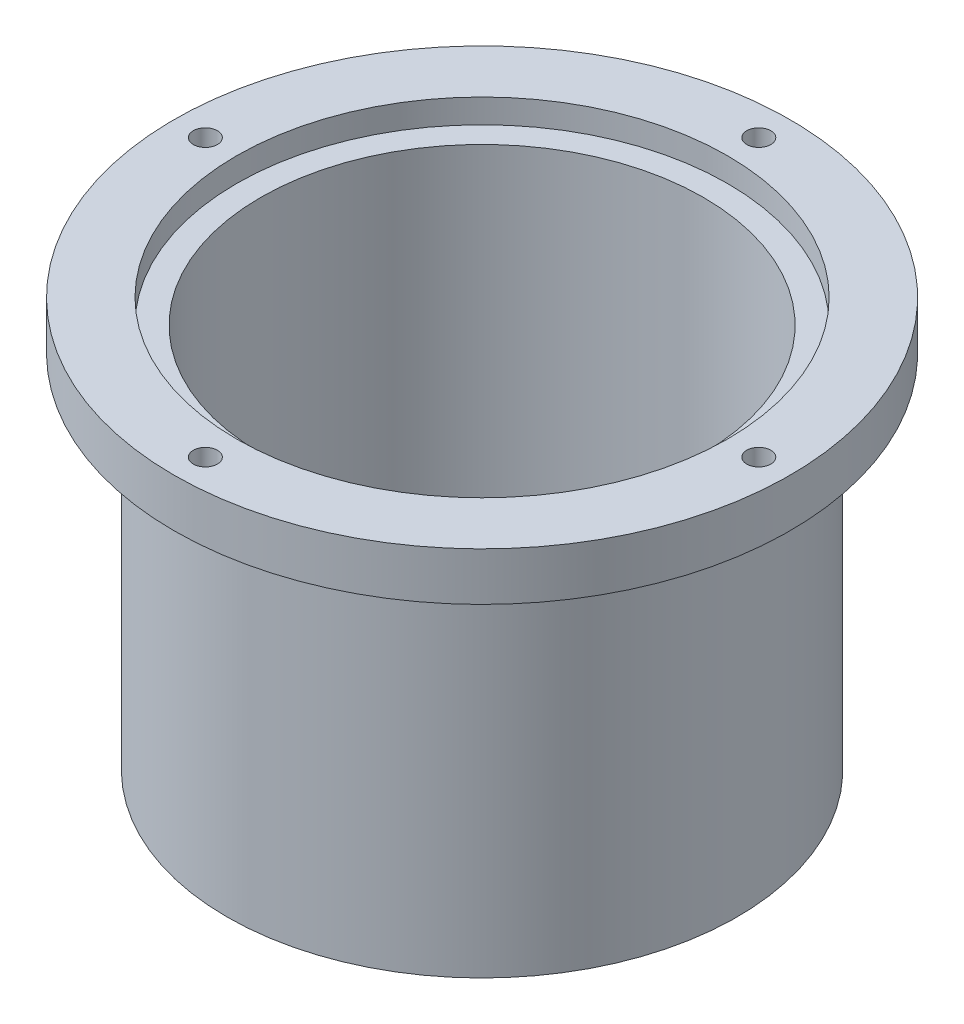
ISO-10303-21;
HEADER;
FILE_DESCRIPTION(('STEP AP214'),'2;1');
FILE_NAME('part.step','',(''),(''),'','','');
FILE_SCHEMA(('AUTOMOTIVE_DESIGN { 1 0 10303 214 1 1 1 1 }'));
ENDSEC;
DATA;
#1=APPLICATION_CONTEXT('core data for automotive mechanical design processes');
#2=APPLICATION_PROTOCOL_DEFINITION('international standard','automotive_design',2000,#1);
#3=PRODUCT_CONTEXT('',#1,'mechanical');
#4=PRODUCT('Part','Part','',(#3));
#5=PRODUCT_RELATED_PRODUCT_CATEGORY('part','',(#4));
#6=PRODUCT_DEFINITION_FORMATION('','',#4);
#7=PRODUCT_DEFINITION_CONTEXT('part definition',#1,'design');
#8=PRODUCT_DEFINITION('design','',#6,#7);
#9=PRODUCT_DEFINITION_SHAPE('','',#8);
#10=(LENGTH_UNIT() NAMED_UNIT(*) SI_UNIT(.MILLI.,.METRE.));
#11=(NAMED_UNIT(*) PLANE_ANGLE_UNIT() SI_UNIT($,.RADIAN.));
#12=(NAMED_UNIT(*) SI_UNIT($,.STERADIAN.) SOLID_ANGLE_UNIT());
#13=UNCERTAINTY_MEASURE_WITH_UNIT(LENGTH_MEASURE(1.E-05),#10,'distance_accuracy_value','');
#14=(GEOMETRIC_REPRESENTATION_CONTEXT(3) GLOBAL_UNCERTAINTY_ASSIGNED_CONTEXT((#13)) GLOBAL_UNIT_ASSIGNED_CONTEXT((#10,
#11,#12)) REPRESENTATION_CONTEXT('',''));
#15=CARTESIAN_POINT('',(0.,0.,0.));
#16=DIRECTION('',(0.,0.,1.));
#17=DIRECTION('',(1.,0.,0.));
#18=AXIS2_PLACEMENT_3D('',#15,#16,#17);
#19=CARTESIAN_POINT('',(0.,75.,0.));
#20=DIRECTION('',(0.,-1.,0.));
#21=DIRECTION('',(0.,0.,-1.));
#22=AXIS2_PLACEMENT_3D('',#19,#20,#21);
#23=CYLINDRICAL_SURFACE('',#22,53.);
#24=CARTESIAN_POINT('',(0.,75.,0.));
#25=DIRECTION('',(0.,1.,0.));
#26=DIRECTION('',(0.,0.,1.));
#27=AXIS2_PLACEMENT_3D('',#24,#25,#26);
#28=CIRCLE('',#27,53.);
#29=CARTESIAN_POINT('',(0.,75.,53.));
#30=VERTEX_POINT('',#29);
#31=EDGE_CURVE('E10',#30,#30,#28,.T.);
#32=ORIENTED_EDGE('',*,*,#31,.F.);
#33=EDGE_LOOP('',(#32));
#34=FACE_BOUND('',#33,.T.);
#35=CARTESIAN_POINT('',(0.,0.,0.));
#36=DIRECTION('',(0.,1.,0.));
#37=DIRECTION('',(0.,0.,1.));
#38=AXIS2_PLACEMENT_3D('',#35,#36,#37);
#39=CIRCLE('',#38,53.);
#40=CARTESIAN_POINT('',(0.,0.,53.));
#41=VERTEX_POINT('',#40);
#42=EDGE_CURVE('E41',#41,#41,#39,.T.);
#43=ORIENTED_EDGE('',*,*,#42,.T.);
#44=EDGE_LOOP('',(#43));
#45=FACE_BOUND('',#44,.T.);
#46=ADVANCED_FACE('F34',(#34,#45),#23,.T.);
#47=CARTESIAN_POINT('',(0.,0.,0.));
#48=DIRECTION('',(0.,1.,0.));
#49=DIRECTION('',(0.,0.,1.));
#50=AXIS2_PLACEMENT_3D('',#47,#48,#49);
#51=PLANE('',#50);
#52=ORIENTED_EDGE('',*,*,#42,.F.);
#53=EDGE_LOOP('',(#52));
#54=FACE_BOUND('',#53,.T.);
#55=ADVANCED_FACE('F104',(#54),#51,.F.);
#56=CARTESIAN_POINT('',(0.,85.,0.));
#57=DIRECTION('',(0.,-1.,0.));
#58=DIRECTION('',(0.,0.,-1.));
#59=AXIS2_PLACEMENT_3D('',#56,#57,#58);
#60=CYLINDRICAL_SURFACE('',#59,64.);
#61=CARTESIAN_POINT('',(0.,85.,0.));
#62=DIRECTION('',(0.,1.,0.));
#63=DIRECTION('',(0.,0.,1.));
#64=AXIS2_PLACEMENT_3D('',#61,#62,#63);
#65=CIRCLE('',#64,64.);
#66=CARTESIAN_POINT('',(0.,85.,64.));
#67=VERTEX_POINT('',#66);
#68=EDGE_CURVE('E46',#67,#67,#65,.T.);
#69=ORIENTED_EDGE('',*,*,#68,.F.);
#70=EDGE_LOOP('',(#69));
#71=FACE_BOUND('',#70,.T.);
#72=CARTESIAN_POINT('',(0.,75.,0.));
#73=DIRECTION('',(0.,1.,0.));
#74=DIRECTION('',(0.,0.,1.));
#75=AXIS2_PLACEMENT_3D('',#72,#73,#74);
#76=CIRCLE('',#75,64.);
#77=CARTESIAN_POINT('',(0.,75.,64.));
#78=VERTEX_POINT('',#77);
#79=EDGE_CURVE('E49',#78,#78,#76,.T.);
#80=ORIENTED_EDGE('',*,*,#79,.T.);
#81=EDGE_LOOP('',(#80));
#82=FACE_BOUND('',#81,.T.);
#83=ADVANCED_FACE('F86',(#71,#82),#60,.T.);
#84=CARTESIAN_POINT('',(0.,85.,0.));
#85=DIRECTION('',(0.,1.,0.));
#86=DIRECTION('',(0.,0.,1.));
#87=AXIS2_PLACEMENT_3D('',#84,#85,#86);
#88=PLANE('',#87);
#89=CARTESIAN_POINT('',(-57.5,85.,0.));
#90=DIRECTION('',(0.,1.,0.));
#91=DIRECTION('',(0.,0.,1.));
#92=AXIS2_PLACEMENT_3D('',#89,#90,#91);
#93=CIRCLE('',#92,2.5);
#94=CARTESIAN_POINT('',(-57.5,85.,2.50000000000001));
#95=VERTEX_POINT('',#94);
#96=EDGE_CURVE('E56',#95,#95,#93,.T.);
#97=ORIENTED_EDGE('',*,*,#96,.F.);
#98=EDGE_LOOP('',(#97));
#99=FACE_BOUND('',#98,.T.);
#100=CARTESIAN_POINT('',(1.93718457888383E-13,85.,-57.5));
#101=DIRECTION('',(0.,1.,0.));
#102=DIRECTION('',(0.,0.,1.));
#103=AXIS2_PLACEMENT_3D('',#100,#101,#102);
#104=CIRCLE('',#103,2.5);
#105=CARTESIAN_POINT('',(1.93718457888383E-13,85.,-55.));
#106=VERTEX_POINT('',#105);
#107=EDGE_CURVE('E214',#106,#106,#104,.T.);
#108=ORIENTED_EDGE('',*,*,#107,.F.);
#109=EDGE_LOOP('',(#108));
#110=FACE_BOUND('',#109,.T.);
#111=CARTESIAN_POINT('',(57.5,85.,3.94478634871863E-13));
#112=DIRECTION('',(0.,1.,0.));
#113=DIRECTION('',(0.,0.,1.));
#114=AXIS2_PLACEMENT_3D('',#111,#112,#113);
#115=CIRCLE('',#114,2.5);
#116=CARTESIAN_POINT('',(57.5,85.,2.5000000000004));
#117=VERTEX_POINT('',#116);
#118=EDGE_CURVE('E217',#117,#117,#115,.T.);
#119=ORIENTED_EDGE('',*,*,#118,.F.);
#120=EDGE_LOOP('',(#119));
#121=FACE_BOUND('',#120,.T.);
#122=CARTESIAN_POINT('',(-5.95238811855343E-13,85.,57.5));
#123=DIRECTION('',(0.,1.,0.));
#124=DIRECTION('',(0.,0.,1.));
#125=AXIS2_PLACEMENT_3D('',#122,#123,#124);
#126=CIRCLE('',#125,2.5);
#127=CARTESIAN_POINT('',(-5.95238811855343E-13,85.,60.));
#128=VERTEX_POINT('',#127);
#129=EDGE_CURVE('E221',#128,#128,#126,.T.);
#130=ORIENTED_EDGE('',*,*,#129,.F.);
#131=EDGE_LOOP('',(#130));
#132=FACE_BOUND('',#131,.T.);
#133=CARTESIAN_POINT('',(0.,85.,0.));
#134=DIRECTION('',(0.,1.,0.));
#135=DIRECTION('',(0.,0.,1.));
#136=AXIS2_PLACEMENT_3D('',#133,#134,#135);
#137=CIRCLE('',#136,51.);
#138=CARTESIAN_POINT('',(0.,85.,51.));
#139=VERTEX_POINT('',#138);
#140=EDGE_CURVE('E72',#139,#139,#137,.T.);
#141=ORIENTED_EDGE('',*,*,#140,.F.);
#142=EDGE_LOOP('',(#141));
#143=FACE_BOUND('',#142,.T.);
#144=ORIENTED_EDGE('',*,*,#68,.T.);
#145=EDGE_LOOP('',(#144));
#146=FACE_BOUND('',#145,.T.);
#147=ADVANCED_FACE('F91',(#99,#110,#121,#132,#143,#146),#88,.T.);
#148=CARTESIAN_POINT('',(0.,75.,0.));
#149=DIRECTION('',(0.,1.,0.));
#150=DIRECTION('',(0.,0.,1.));
#151=AXIS2_PLACEMENT_3D('',#148,#149,#150);
#152=PLANE('',#151);
#153=CARTESIAN_POINT('',(-57.5,75.,0.));
#154=DIRECTION('',(0.,1.,0.));
#155=DIRECTION('',(0.,0.,1.));
#156=AXIS2_PLACEMENT_3D('',#153,#154,#155);
#157=CIRCLE('',#156,2.5);
#158=CARTESIAN_POINT('',(-57.5,75.,2.50000000000001));
#159=VERTEX_POINT('',#158);
#160=EDGE_CURVE('E37',#159,#159,#157,.T.);
#161=ORIENTED_EDGE('',*,*,#160,.T.);
#162=EDGE_LOOP('',(#161));
#163=FACE_BOUND('',#162,.T.);
#164=CARTESIAN_POINT('',(1.93718457888383E-13,75.,-57.5));
#165=DIRECTION('',(0.,1.,0.));
#166=DIRECTION('',(0.,0.,1.));
#167=AXIS2_PLACEMENT_3D('',#164,#165,#166);
#168=CIRCLE('',#167,2.5);
#169=CARTESIAN_POINT('',(1.93718457888383E-13,75.,-55.));
#170=VERTEX_POINT('',#169);
#171=EDGE_CURVE('E58',#170,#170,#168,.T.);
#172=ORIENTED_EDGE('',*,*,#171,.T.);
#173=EDGE_LOOP('',(#172));
#174=FACE_BOUND('',#173,.T.);
#175=CARTESIAN_POINT('',(57.5,75.,3.94478634871863E-13));
#176=DIRECTION('',(0.,1.,0.));
#177=DIRECTION('',(0.,0.,1.));
#178=AXIS2_PLACEMENT_3D('',#175,#176,#177);
#179=CIRCLE('',#178,2.5);
#180=CARTESIAN_POINT('',(57.5,75.,2.5000000000004));
#181=VERTEX_POINT('',#180);
#182=EDGE_CURVE('E55',#181,#181,#179,.T.);
#183=ORIENTED_EDGE('',*,*,#182,.T.);
#184=EDGE_LOOP('',(#183));
#185=FACE_BOUND('',#184,.T.);
#186=CARTESIAN_POINT('',(-5.95238811855343E-13,75.,57.5));
#187=DIRECTION('',(0.,1.,0.));
#188=DIRECTION('',(0.,0.,1.));
#189=AXIS2_PLACEMENT_3D('',#186,#187,#188);
#190=CIRCLE('',#189,2.5);
#191=CARTESIAN_POINT('',(-5.95238811855343E-13,75.,60.));
#192=VERTEX_POINT('',#191);
#193=EDGE_CURVE('E52',#192,#192,#190,.T.);
#194=ORIENTED_EDGE('',*,*,#193,.T.);
#195=EDGE_LOOP('',(#194));
#196=FACE_BOUND('',#195,.T.);
#197=ORIENTED_EDGE('',*,*,#31,.T.);
#198=EDGE_LOOP('',(#197));
#199=FACE_BOUND('',#198,.T.);
#200=ORIENTED_EDGE('',*,*,#79,.F.);
#201=EDGE_LOOP('',(#200));
#202=FACE_BOUND('',#201,.T.);
#203=ADVANCED_FACE('F88',(#163,#174,#185,#196,#199,#202),#152,.F.);
#204=CARTESIAN_POINT('',(0.,80.,0.));
#205=DIRECTION('',(0.,1.,0.));
#206=DIRECTION('',(0.,0.,1.));
#207=AXIS2_PLACEMENT_3D('',#204,#205,#206);
#208=CYLINDRICAL_SURFACE('',#207,51.);
#209=CARTESIAN_POINT('',(0.,80.,0.));
#210=DIRECTION('',(0.,1.,0.));
#211=DIRECTION('',(0.,0.,1.));
#212=AXIS2_PLACEMENT_3D('',#209,#210,#211);
#213=CIRCLE('',#212,51.);
#214=CARTESIAN_POINT('',(0.,80.,51.));
#215=VERTEX_POINT('',#214);
#216=EDGE_CURVE('E76',#215,#215,#213,.T.);
#217=ORIENTED_EDGE('',*,*,#216,.F.);
#218=EDGE_LOOP('',(#217));
#219=FACE_BOUND('',#218,.T.);
#220=ORIENTED_EDGE('',*,*,#140,.T.);
#221=EDGE_LOOP('',(#220));
#222=FACE_BOUND('',#221,.T.);
#223=ADVANCED_FACE('F90',(#219,#222),#208,.F.);
#224=CARTESIAN_POINT('',(0.,80.,0.));
#225=DIRECTION('',(0.,1.,0.));
#226=DIRECTION('',(0.,0.,1.));
#227=AXIS2_PLACEMENT_3D('',#224,#225,#226);
#228=PLANE('',#227);
#229=CARTESIAN_POINT('',(0.,80.,0.));
#230=DIRECTION('',(0.,1.,0.));
#231=DIRECTION('',(0.,0.,1.));
#232=AXIS2_PLACEMENT_3D('',#229,#230,#231);
#233=CIRCLE('',#232,46.);
#234=CARTESIAN_POINT('',(0.,80.,46.));
#235=VERTEX_POINT('',#234);
#236=EDGE_CURVE('E63',#235,#235,#233,.T.);
#237=ORIENTED_EDGE('',*,*,#236,.F.);
#238=EDGE_LOOP('',(#237));
#239=FACE_BOUND('',#238,.T.);
#240=ORIENTED_EDGE('',*,*,#216,.T.);
#241=EDGE_LOOP('',(#240));
#242=FACE_BOUND('',#241,.T.);
#243=ADVANCED_FACE('F97',(#239,#242),#228,.T.);
#244=CARTESIAN_POINT('',(0.,14.,0.));
#245=DIRECTION('',(0.,1.,0.));
#246=DIRECTION('',(0.,0.,1.));
#247=AXIS2_PLACEMENT_3D('',#244,#245,#246);
#248=CYLINDRICAL_SURFACE('',#247,46.);
#249=CARTESIAN_POINT('',(0.,14.,0.));
#250=DIRECTION('',(0.,1.,0.));
#251=DIRECTION('',(0.,0.,1.));
#252=AXIS2_PLACEMENT_3D('',#249,#250,#251);
#253=CIRCLE('',#252,46.);
#254=CARTESIAN_POINT('',(0.,14.,46.));
#255=VERTEX_POINT('',#254);
#256=EDGE_CURVE('E67',#255,#255,#253,.T.);
#257=ORIENTED_EDGE('',*,*,#256,.F.);
#258=EDGE_LOOP('',(#257));
#259=FACE_BOUND('',#258,.T.);
#260=ORIENTED_EDGE('',*,*,#236,.T.);
#261=EDGE_LOOP('',(#260));
#262=FACE_BOUND('',#261,.T.);
#263=ADVANCED_FACE('F182',(#259,#262),#248,.F.);
#264=CARTESIAN_POINT('',(0.,14.,0.));
#265=DIRECTION('',(0.,1.,0.));
#266=DIRECTION('',(0.,0.,1.));
#267=AXIS2_PLACEMENT_3D('',#264,#265,#266);
#268=PLANE('',#267);
#269=ORIENTED_EDGE('',*,*,#256,.T.);
#270=EDGE_LOOP('',(#269));
#271=FACE_BOUND('',#270,.T.);
#272=ADVANCED_FACE('F129',(#271),#268,.T.);
#273=CARTESIAN_POINT('',(-5.95238811855343E-13,19.,57.5));
#274=DIRECTION('',(0.,1.,0.));
#275=DIRECTION('',(0.,0.,1.));
#276=AXIS2_PLACEMENT_3D('',#273,#274,#275);
#277=CYLINDRICAL_SURFACE('',#276,2.5);
#278=ORIENTED_EDGE('',*,*,#129,.T.);
#279=EDGE_LOOP('',(#278));
#280=FACE_BOUND('',#279,.T.);
#281=ORIENTED_EDGE('',*,*,#193,.F.);
#282=EDGE_LOOP('',(#281));
#283=FACE_BOUND('',#282,.T.);
#284=ADVANCED_FACE('F139',(#280,#283),#277,.F.);
#285=CARTESIAN_POINT('',(57.5,19.,3.94478634871863E-13));
#286=DIRECTION('',(0.,1.,0.));
#287=DIRECTION('',(0.,0.,1.));
#288=AXIS2_PLACEMENT_3D('',#285,#286,#287);
#289=CYLINDRICAL_SURFACE('',#288,2.5);
#290=ORIENTED_EDGE('',*,*,#118,.T.);
#291=EDGE_LOOP('',(#290));
#292=FACE_BOUND('',#291,.T.);
#293=ORIENTED_EDGE('',*,*,#182,.F.);
#294=EDGE_LOOP('',(#293));
#295=FACE_BOUND('',#294,.T.);
#296=ADVANCED_FACE('F144',(#292,#295),#289,.F.);
#297=CARTESIAN_POINT('',(1.93718457888383E-13,19.,-57.5));
#298=DIRECTION('',(0.,1.,0.));
#299=DIRECTION('',(0.,0.,1.));
#300=AXIS2_PLACEMENT_3D('',#297,#298,#299);
#301=CYLINDRICAL_SURFACE('',#300,2.5);
#302=ORIENTED_EDGE('',*,*,#107,.T.);
#303=EDGE_LOOP('',(#302));
#304=FACE_BOUND('',#303,.T.);
#305=ORIENTED_EDGE('',*,*,#171,.F.);
#306=EDGE_LOOP('',(#305));
#307=FACE_BOUND('',#306,.T.);
#308=ADVANCED_FACE('F154',(#304,#307),#301,.F.);
#309=CARTESIAN_POINT('',(-57.5,19.,0.));
#310=DIRECTION('',(0.,1.,0.));
#311=DIRECTION('',(0.,0.,1.));
#312=AXIS2_PLACEMENT_3D('',#309,#310,#311);
#313=CYLINDRICAL_SURFACE('',#312,2.5);
#314=ORIENTED_EDGE('',*,*,#96,.T.);
#315=EDGE_LOOP('',(#314));
#316=FACE_BOUND('',#315,.T.);
#317=ORIENTED_EDGE('',*,*,#160,.F.);
#318=EDGE_LOOP('',(#317));
#319=FACE_BOUND('',#318,.T.);
#320=ADVANCED_FACE('F164',(#316,#319),#313,.F.);
#321=CLOSED_SHELL('',(#46,#55,#83,#147,#203,#223,#243,#263,#272,#284,#296,#308,#320));
#322=MANIFOLD_SOLID_BREP('B2',#321);
#323=ADVANCED_BREP_SHAPE_REPRESENTATION('',(#18,#322),#14);
#324=SHAPE_DEFINITION_REPRESENTATION(#9,#323);
ENDSEC;
END-ISO-10303-21;
